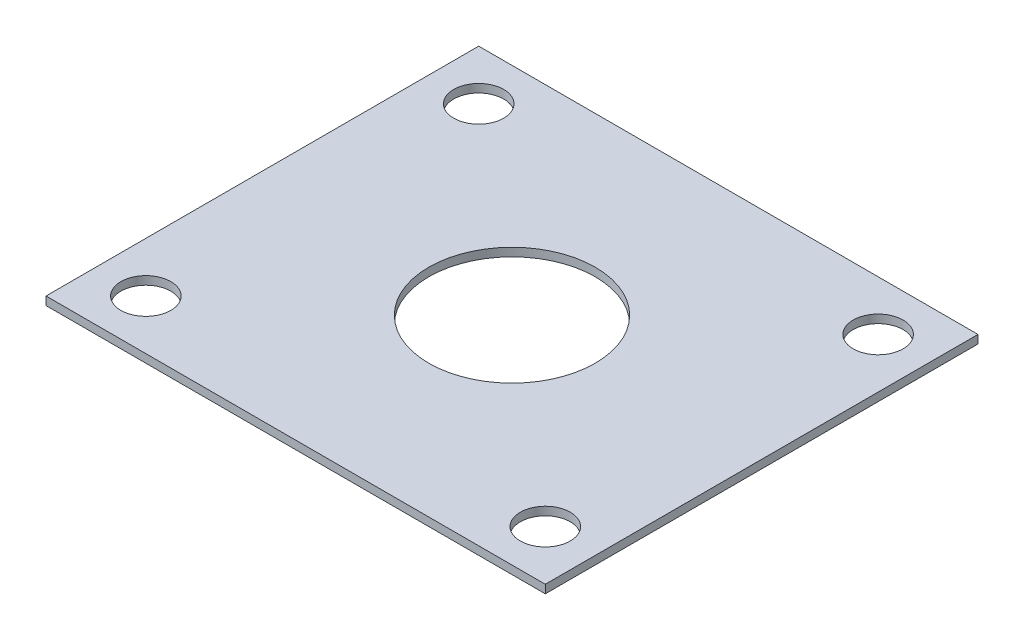
ISO-10303-21;
HEADER;
FILE_DESCRIPTION(('STEP AP214'),'2;1');
FILE_NAME('part.step','',(''),(''),'','','');
FILE_SCHEMA(('AUTOMOTIVE_DESIGN { 1 0 10303 214 1 1 1 1 }'));
ENDSEC;
DATA;
#1=APPLICATION_CONTEXT('core data for automotive mechanical design processes');
#2=APPLICATION_PROTOCOL_DEFINITION('international standard','automotive_design',2000,#1);
#3=PRODUCT_CONTEXT('',#1,'mechanical');
#4=PRODUCT('Part','Part','',(#3));
#5=PRODUCT_RELATED_PRODUCT_CATEGORY('part','',(#4));
#6=PRODUCT_DEFINITION_FORMATION('','',#4);
#7=PRODUCT_DEFINITION_CONTEXT('part definition',#1,'design');
#8=PRODUCT_DEFINITION('design','',#6,#7);
#9=PRODUCT_DEFINITION_SHAPE('','',#8);
#10=(LENGTH_UNIT() NAMED_UNIT(*) SI_UNIT(.MILLI.,.METRE.));
#11=(NAMED_UNIT(*) PLANE_ANGLE_UNIT() SI_UNIT($,.RADIAN.));
#12=(NAMED_UNIT(*) SI_UNIT($,.STERADIAN.) SOLID_ANGLE_UNIT());
#13=UNCERTAINTY_MEASURE_WITH_UNIT(LENGTH_MEASURE(1.E-05),#10,'distance_accuracy_value','');
#14=(GEOMETRIC_REPRESENTATION_CONTEXT(3) GLOBAL_UNCERTAINTY_ASSIGNED_CONTEXT((#13)) GLOBAL_UNIT_ASSIGNED_CONTEXT((#10,
#11,#12)) REPRESENTATION_CONTEXT('',''));
#15=CARTESIAN_POINT('',(0.,0.,0.));
#16=DIRECTION('',(0.,0.,1.));
#17=DIRECTION('',(1.,0.,0.));
#18=AXIS2_PLACEMENT_3D('',#15,#16,#17);
#19=CARTESIAN_POINT('',(0.,0.635,0.));
#20=DIRECTION('',(-1.,0.,0.));
#21=DIRECTION('',(0.,0.,1.));
#22=AXIS2_PLACEMENT_3D('',#19,#20,#21);
#23=PLANE('',#22);
#24=DIRECTION('',(0.,0.,-1.));
#25=VECTOR('',#24,1.);
#26=CARTESIAN_POINT('',(0.,0.,0.));
#27=LINE('',#26,#25);
#28=CARTESIAN_POINT('',(0.,0.,0.));
#29=VERTEX_POINT('',#28);
#30=CARTESIAN_POINT('',(0.,0.,-33.02));
#31=VERTEX_POINT('',#30);
#32=EDGE_CURVE('E96',#29,#31,#27,.T.);
#33=ORIENTED_EDGE('',*,*,#32,.T.);
#34=DIRECTION('',(0.,-1.,0.));
#35=VECTOR('',#34,1.);
#36=CARTESIAN_POINT('',(0.,0.635,-33.02));
#37=LINE('',#36,#35);
#38=CARTESIAN_POINT('',(0.,0.635,-33.02));
#39=VERTEX_POINT('',#38);
#40=EDGE_CURVE('E11',#39,#31,#37,.T.);
#41=ORIENTED_EDGE('',*,*,#40,.F.);
#42=DIRECTION('',(0.,0.,-1.));
#43=VECTOR('',#42,1.);
#44=CARTESIAN_POINT('',(0.,0.635,0.));
#45=LINE('',#44,#43);
#46=CARTESIAN_POINT('',(0.,0.635,0.));
#47=VERTEX_POINT('',#46);
#48=EDGE_CURVE('E84',#47,#39,#45,.T.);
#49=ORIENTED_EDGE('',*,*,#48,.F.);
#50=DIRECTION('',(0.,-1.,0.));
#51=VECTOR('',#50,1.);
#52=CARTESIAN_POINT('',(0.,0.635,0.));
#53=LINE('',#52,#51);
#54=EDGE_CURVE('E92',#47,#29,#53,.T.);
#55=ORIENTED_EDGE('',*,*,#54,.T.);
#56=EDGE_LOOP('',(#33,#41,#49,#55));
#57=FACE_BOUND('',#56,.T.);
#58=ADVANCED_FACE('F33',(#57),#23,.F.);
#59=CARTESIAN_POINT('',(0.,0.635,-33.02));
#60=DIRECTION('',(0.,0.,1.));
#61=DIRECTION('',(1.,0.,0.));
#62=AXIS2_PLACEMENT_3D('',#59,#60,#61);
#63=PLANE('',#62);
#64=DIRECTION('',(-1.,0.,0.));
#65=VECTOR('',#64,1.);
#66=CARTESIAN_POINT('',(0.,0.,-33.02));
#67=LINE('',#66,#65);
#68=CARTESIAN_POINT('',(-38.1,0.,-33.02));
#69=VERTEX_POINT('',#68);
#70=EDGE_CURVE('E88',#31,#69,#67,.T.);
#71=ORIENTED_EDGE('',*,*,#70,.T.);
#72=DIRECTION('',(0.,-1.,0.));
#73=VECTOR('',#72,1.);
#74=CARTESIAN_POINT('',(-38.1,0.635,-33.02));
#75=LINE('',#74,#73);
#76=CARTESIAN_POINT('',(-38.1,0.635,-33.02));
#77=VERTEX_POINT('',#76);
#78=EDGE_CURVE('E41',#77,#69,#75,.T.);
#79=ORIENTED_EDGE('',*,*,#78,.F.);
#80=DIRECTION('',(-1.,0.,0.));
#81=VECTOR('',#80,1.);
#82=CARTESIAN_POINT('',(0.,0.635,-33.02));
#83=LINE('',#82,#81);
#84=EDGE_CURVE('E79',#39,#77,#83,.T.);
#85=ORIENTED_EDGE('',*,*,#84,.F.);
#86=ORIENTED_EDGE('',*,*,#40,.T.);
#87=EDGE_LOOP('',(#71,#79,#85,#86));
#88=FACE_BOUND('',#87,.T.);
#89=ADVANCED_FACE('F87',(#88),#63,.F.);
#90=CARTESIAN_POINT('',(-38.1,0.635,0.));
#91=DIRECTION('',(1.,0.,0.));
#92=DIRECTION('',(0.,0.,-1.));
#93=AXIS2_PLACEMENT_3D('',#90,#91,#92);
#94=PLANE('',#93);
#95=DIRECTION('',(0.,0.,1.));
#96=VECTOR('',#95,1.);
#97=CARTESIAN_POINT('',(-38.1,0.,0.));
#98=LINE('',#97,#96);
#99=CARTESIAN_POINT('',(-38.1,0.,0.));
#100=VERTEX_POINT('',#99);
#101=EDGE_CURVE('E66',#69,#100,#98,.T.);
#102=ORIENTED_EDGE('',*,*,#101,.T.);
#103=DIRECTION('',(0.,-1.,0.));
#104=VECTOR('',#103,1.);
#105=CARTESIAN_POINT('',(-38.1,0.635,0.));
#106=LINE('',#105,#104);
#107=CARTESIAN_POINT('',(-38.1,0.635,0.));
#108=VERTEX_POINT('',#107);
#109=EDGE_CURVE('E89',#108,#100,#106,.T.);
#110=ORIENTED_EDGE('',*,*,#109,.F.);
#111=DIRECTION('',(0.,0.,1.));
#112=VECTOR('',#111,1.);
#113=CARTESIAN_POINT('',(-38.1,0.635,0.));
#114=LINE('',#113,#112);
#115=EDGE_CURVE('E82',#77,#108,#114,.T.);
#116=ORIENTED_EDGE('',*,*,#115,.F.);
#117=ORIENTED_EDGE('',*,*,#78,.T.);
#118=EDGE_LOOP('',(#102,#110,#116,#117));
#119=FACE_BOUND('',#118,.T.);
#120=ADVANCED_FACE('F90',(#119),#94,.F.);
#121=CARTESIAN_POINT('',(0.,0.635,0.));
#122=DIRECTION('',(0.,0.,-1.));
#123=DIRECTION('',(-1.,0.,0.));
#124=AXIS2_PLACEMENT_3D('',#121,#122,#123);
#125=PLANE('',#124);
#126=DIRECTION('',(1.,0.,0.));
#127=VECTOR('',#126,1.);
#128=CARTESIAN_POINT('',(0.,0.,0.));
#129=LINE('',#128,#127);
#130=EDGE_CURVE('E72',#100,#29,#129,.T.);
#131=ORIENTED_EDGE('',*,*,#130,.T.);
#132=ORIENTED_EDGE('',*,*,#54,.F.);
#133=DIRECTION('',(1.,0.,0.));
#134=VECTOR('',#133,1.);
#135=CARTESIAN_POINT('',(0.,0.635,0.));
#136=LINE('',#135,#134);
#137=EDGE_CURVE('E49',#108,#47,#136,.T.);
#138=ORIENTED_EDGE('',*,*,#137,.F.);
#139=ORIENTED_EDGE('',*,*,#109,.T.);
#140=EDGE_LOOP('',(#131,#132,#138,#139));
#141=FACE_BOUND('',#140,.T.);
#142=ADVANCED_FACE('F104',(#141),#125,.F.);
#143=CARTESIAN_POINT('',(0.,0.635,0.));
#144=DIRECTION('',(0.,1.,0.));
#145=DIRECTION('',(0.,0.,1.));
#146=AXIS2_PLACEMENT_3D('',#143,#144,#145);
#147=PLANE('',#146);
#148=CARTESIAN_POINT('',(-19.05,0.635,-16.51));
#149=DIRECTION('',(0.,1.,0.));
#150=DIRECTION('',(0.,0.,1.));
#151=AXIS2_PLACEMENT_3D('',#148,#149,#150);
#152=CIRCLE('',#151,6.35);
#153=CARTESIAN_POINT('',(-19.05,0.635,-10.16));
#154=VERTEX_POINT('',#153);
#155=EDGE_CURVE('E134',#154,#154,#152,.T.);
#156=ORIENTED_EDGE('',*,*,#155,.F.);
#157=EDGE_LOOP('',(#156));
#158=FACE_BOUND('',#157,.T.);
#159=CARTESIAN_POINT('',(-34.29,0.635,-3.81));
#160=DIRECTION('',(0.,1.,0.));
#161=DIRECTION('',(0.,0.,1.));
#162=AXIS2_PLACEMENT_3D('',#159,#160,#161);
#163=CIRCLE('',#162,1.905);
#164=CARTESIAN_POINT('',(-34.29,0.635,-1.905));
#165=VERTEX_POINT('',#164);
#166=EDGE_CURVE('E123',#165,#165,#163,.T.);
#167=ORIENTED_EDGE('',*,*,#166,.F.);
#168=EDGE_LOOP('',(#167));
#169=FACE_BOUND('',#168,.T.);
#170=CARTESIAN_POINT('',(-3.81,0.635,-29.21));
#171=DIRECTION('',(0.,1.,0.));
#172=DIRECTION('',(0.,0.,1.));
#173=AXIS2_PLACEMENT_3D('',#170,#171,#172);
#174=CIRCLE('',#173,1.905);
#175=CARTESIAN_POINT('',(-3.81,0.635,-27.305));
#176=VERTEX_POINT('',#175);
#177=EDGE_CURVE('E116',#176,#176,#174,.T.);
#178=ORIENTED_EDGE('',*,*,#177,.F.);
#179=EDGE_LOOP('',(#178));
#180=FACE_BOUND('',#179,.T.);
#181=CARTESIAN_POINT('',(-3.81,0.635,-3.81));
#182=DIRECTION('',(0.,1.,0.));
#183=DIRECTION('',(0.,0.,1.));
#184=AXIS2_PLACEMENT_3D('',#181,#182,#183);
#185=CIRCLE('',#184,1.905);
#186=CARTESIAN_POINT('',(-3.81,0.635,-1.905));
#187=VERTEX_POINT('',#186);
#188=EDGE_CURVE('E128',#187,#187,#185,.T.);
#189=ORIENTED_EDGE('',*,*,#188,.F.);
#190=EDGE_LOOP('',(#189));
#191=FACE_BOUND('',#190,.T.);
#192=CARTESIAN_POINT('',(-34.29,0.635,-29.21));
#193=DIRECTION('',(0.,1.,0.));
#194=DIRECTION('',(0.,0.,1.));
#195=AXIS2_PLACEMENT_3D('',#192,#193,#194);
#196=CIRCLE('',#195,1.905);
#197=CARTESIAN_POINT('',(-34.29,0.635,-27.305));
#198=VERTEX_POINT('',#197);
#199=EDGE_CURVE('E110',#198,#198,#196,.T.);
#200=ORIENTED_EDGE('',*,*,#199,.F.);
#201=EDGE_LOOP('',(#200));
#202=FACE_BOUND('',#201,.T.);
#203=ORIENTED_EDGE('',*,*,#48,.T.);
#204=ORIENTED_EDGE('',*,*,#84,.T.);
#205=ORIENTED_EDGE('',*,*,#115,.T.);
#206=ORIENTED_EDGE('',*,*,#137,.T.);
#207=EDGE_LOOP('',(#203,#204,#205,#206));
#208=FACE_BOUND('',#207,.T.);
#209=ADVANCED_FACE('F80',(#158,#169,#180,#191,#202,#208),#147,.T.);
#210=CARTESIAN_POINT('',(0.,0.,0.));
#211=DIRECTION('',(0.,1.,0.));
#212=DIRECTION('',(0.,0.,1.));
#213=AXIS2_PLACEMENT_3D('',#210,#211,#212);
#214=PLANE('',#213);
#215=CARTESIAN_POINT('',(-19.05,0.,-16.51));
#216=DIRECTION('',(0.,1.,0.));
#217=DIRECTION('',(0.,0.,1.));
#218=AXIS2_PLACEMENT_3D('',#215,#216,#217);
#219=CIRCLE('',#218,6.35);
#220=CARTESIAN_POINT('',(-19.05,0.,-10.16));
#221=VERTEX_POINT('',#220);
#222=EDGE_CURVE('E131',#221,#221,#219,.T.);
#223=ORIENTED_EDGE('',*,*,#222,.T.);
#224=EDGE_LOOP('',(#223));
#225=FACE_BOUND('',#224,.T.);
#226=CARTESIAN_POINT('',(-34.29,0.,-3.81));
#227=DIRECTION('',(0.,1.,0.));
#228=DIRECTION('',(0.,0.,1.));
#229=AXIS2_PLACEMENT_3D('',#226,#227,#228);
#230=CIRCLE('',#229,1.905);
#231=CARTESIAN_POINT('',(-34.29,0.,-1.905));
#232=VERTEX_POINT('',#231);
#233=EDGE_CURVE('E113',#232,#232,#230,.T.);
#234=ORIENTED_EDGE('',*,*,#233,.T.);
#235=EDGE_LOOP('',(#234));
#236=FACE_BOUND('',#235,.T.);
#237=CARTESIAN_POINT('',(-3.81,0.,-29.21));
#238=DIRECTION('',(0.,1.,0.));
#239=DIRECTION('',(0.,0.,1.));
#240=AXIS2_PLACEMENT_3D('',#237,#238,#239);
#241=CIRCLE('',#240,1.905);
#242=CARTESIAN_POINT('',(-3.81,0.,-27.305));
#243=VERTEX_POINT('',#242);
#244=EDGE_CURVE('E119',#243,#243,#241,.T.);
#245=ORIENTED_EDGE('',*,*,#244,.T.);
#246=EDGE_LOOP('',(#245));
#247=FACE_BOUND('',#246,.T.);
#248=CARTESIAN_POINT('',(-3.81,0.,-3.81));
#249=DIRECTION('',(0.,1.,0.));
#250=DIRECTION('',(0.,0.,1.));
#251=AXIS2_PLACEMENT_3D('',#248,#249,#250);
#252=CIRCLE('',#251,1.905);
#253=CARTESIAN_POINT('',(-3.81,0.,-1.905));
#254=VERTEX_POINT('',#253);
#255=EDGE_CURVE('E120',#254,#254,#252,.T.);
#256=ORIENTED_EDGE('',*,*,#255,.T.);
#257=EDGE_LOOP('',(#256));
#258=FACE_BOUND('',#257,.T.);
#259=CARTESIAN_POINT('',(-34.29,0.,-29.21));
#260=DIRECTION('',(0.,1.,0.));
#261=DIRECTION('',(0.,0.,1.));
#262=AXIS2_PLACEMENT_3D('',#259,#260,#261);
#263=CIRCLE('',#262,1.905);
#264=CARTESIAN_POINT('',(-34.29,0.,-27.305));
#265=VERTEX_POINT('',#264);
#266=EDGE_CURVE('E99',#265,#265,#263,.T.);
#267=ORIENTED_EDGE('',*,*,#266,.T.);
#268=EDGE_LOOP('',(#267));
#269=FACE_BOUND('',#268,.T.);
#270=ORIENTED_EDGE('',*,*,#32,.F.);
#271=ORIENTED_EDGE('',*,*,#130,.F.);
#272=ORIENTED_EDGE('',*,*,#101,.F.);
#273=ORIENTED_EDGE('',*,*,#70,.F.);
#274=EDGE_LOOP('',(#270,#271,#272,#273));
#275=FACE_BOUND('',#274,.T.);
#276=ADVANCED_FACE('F107',(#225,#236,#247,#258,#269,#275),#214,.F.);
#277=CARTESIAN_POINT('',(-34.29,0.,-29.21));
#278=DIRECTION('',(0.,1.,0.));
#279=DIRECTION('',(0.,0.,1.));
#280=AXIS2_PLACEMENT_3D('',#277,#278,#279);
#281=CYLINDRICAL_SURFACE('',#280,1.905);
#282=ORIENTED_EDGE('',*,*,#266,.F.);
#283=EDGE_LOOP('',(#282));
#284=FACE_BOUND('',#283,.T.);
#285=ORIENTED_EDGE('',*,*,#199,.T.);
#286=EDGE_LOOP('',(#285));
#287=FACE_BOUND('',#286,.T.);
#288=ADVANCED_FACE('F160',(#284,#287),#281,.F.);
#289=CARTESIAN_POINT('',(-3.81,0.,-3.81));
#290=DIRECTION('',(0.,1.,0.));
#291=DIRECTION('',(0.,0.,1.));
#292=AXIS2_PLACEMENT_3D('',#289,#290,#291);
#293=CYLINDRICAL_SURFACE('',#292,1.905);
#294=ORIENTED_EDGE('',*,*,#255,.F.);
#295=EDGE_LOOP('',(#294));
#296=FACE_BOUND('',#295,.T.);
#297=ORIENTED_EDGE('',*,*,#188,.T.);
#298=EDGE_LOOP('',(#297));
#299=FACE_BOUND('',#298,.T.);
#300=ADVANCED_FACE('F162',(#296,#299),#293,.F.);
#301=CARTESIAN_POINT('',(-3.81,0.,-29.21));
#302=DIRECTION('',(0.,1.,0.));
#303=DIRECTION('',(0.,0.,1.));
#304=AXIS2_PLACEMENT_3D('',#301,#302,#303);
#305=CYLINDRICAL_SURFACE('',#304,1.905);
#306=ORIENTED_EDGE('',*,*,#244,.F.);
#307=EDGE_LOOP('',(#306));
#308=FACE_BOUND('',#307,.T.);
#309=ORIENTED_EDGE('',*,*,#177,.T.);
#310=EDGE_LOOP('',(#309));
#311=FACE_BOUND('',#310,.T.);
#312=ADVANCED_FACE('F169',(#308,#311),#305,.F.);
#313=CARTESIAN_POINT('',(-34.29,0.,-3.81));
#314=DIRECTION('',(0.,1.,0.));
#315=DIRECTION('',(0.,0.,1.));
#316=AXIS2_PLACEMENT_3D('',#313,#314,#315);
#317=CYLINDRICAL_SURFACE('',#316,1.905);
#318=ORIENTED_EDGE('',*,*,#233,.F.);
#319=EDGE_LOOP('',(#318));
#320=FACE_BOUND('',#319,.T.);
#321=ORIENTED_EDGE('',*,*,#166,.T.);
#322=EDGE_LOOP('',(#321));
#323=FACE_BOUND('',#322,.T.);
#324=ADVANCED_FACE('F145',(#320,#323),#317,.F.);
#325=CARTESIAN_POINT('',(-19.05,0.,-16.51));
#326=DIRECTION('',(0.,1.,0.));
#327=DIRECTION('',(0.,0.,1.));
#328=AXIS2_PLACEMENT_3D('',#325,#326,#327);
#329=CYLINDRICAL_SURFACE('',#328,6.35);
#330=ORIENTED_EDGE('',*,*,#222,.F.);
#331=EDGE_LOOP('',(#330));
#332=FACE_BOUND('',#331,.T.);
#333=ORIENTED_EDGE('',*,*,#155,.T.);
#334=EDGE_LOOP('',(#333));
#335=FACE_BOUND('',#334,.T.);
#336=ADVANCED_FACE('F142',(#332,#335),#329,.F.);
#337=CLOSED_SHELL('',(#58,#89,#120,#142,#209,#276,#288,#300,#312,#324,#336));
#338=MANIFOLD_SOLID_BREP('B2',#337);
#339=ADVANCED_BREP_SHAPE_REPRESENTATION('',(#18,#338),#14);
#340=SHAPE_DEFINITION_REPRESENTATION(#9,#339);
ENDSEC;
END-ISO-10303-21;
